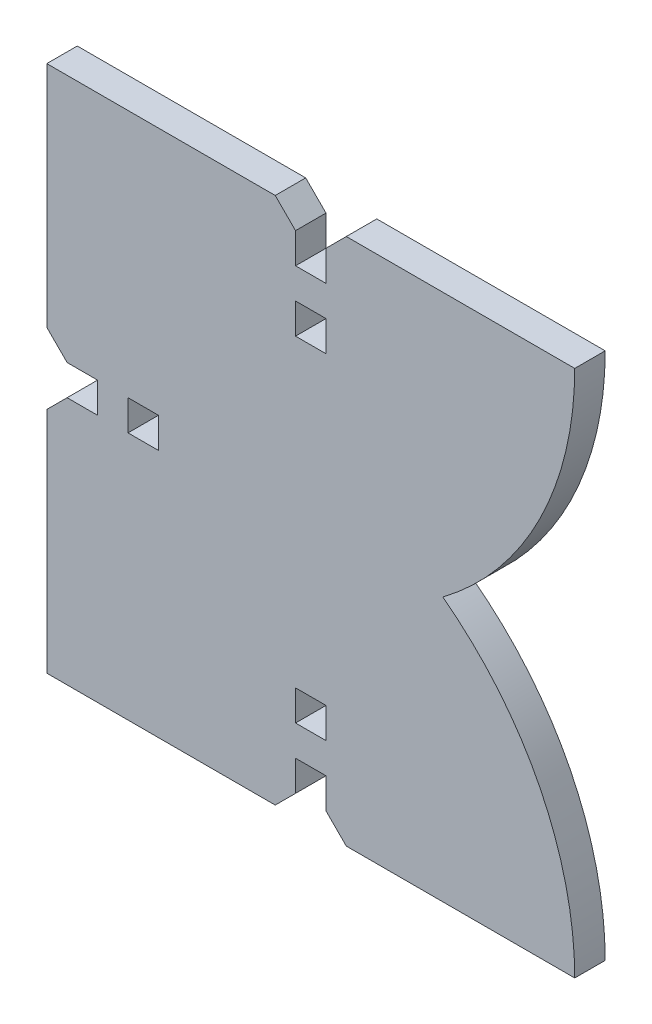
ISO-10303-21;
HEADER;
FILE_DESCRIPTION(('STEP AP214'),'2;1');
FILE_NAME('part.step','',(''),(''),'','','');
FILE_SCHEMA(('AUTOMOTIVE_DESIGN { 1 0 10303 214 1 1 1 1 }'));
ENDSEC;
DATA;
#1=APPLICATION_CONTEXT('core data for automotive mechanical design processes');
#2=APPLICATION_PROTOCOL_DEFINITION('international standard','automotive_design',2000,#1);
#3=PRODUCT_CONTEXT('',#1,'mechanical');
#4=PRODUCT('Part','Part','',(#3));
#5=PRODUCT_RELATED_PRODUCT_CATEGORY('part','',(#4));
#6=PRODUCT_DEFINITION_FORMATION('','',#4);
#7=PRODUCT_DEFINITION_CONTEXT('part definition',#1,'design');
#8=PRODUCT_DEFINITION('design','',#6,#7);
#9=PRODUCT_DEFINITION_SHAPE('','',#8);
#10=(LENGTH_UNIT() NAMED_UNIT(*) SI_UNIT(.MILLI.,.METRE.));
#11=(NAMED_UNIT(*) PLANE_ANGLE_UNIT() SI_UNIT($,.RADIAN.));
#12=(NAMED_UNIT(*) SI_UNIT($,.STERADIAN.) SOLID_ANGLE_UNIT());
#13=UNCERTAINTY_MEASURE_WITH_UNIT(LENGTH_MEASURE(1.E-05),#10,'distance_accuracy_value','');
#14=(GEOMETRIC_REPRESENTATION_CONTEXT(3) GLOBAL_UNCERTAINTY_ASSIGNED_CONTEXT((#13)) GLOBAL_UNIT_ASSIGNED_CONTEXT((#10,
#11,#12)) REPRESENTATION_CONTEXT('',''));
#15=CARTESIAN_POINT('',(0.,0.,0.));
#16=DIRECTION('',(0.,0.,1.));
#17=DIRECTION('',(1.,0.,0.));
#18=AXIS2_PLACEMENT_3D('',#15,#16,#17);
#19=CARTESIAN_POINT('',(0.,0.,3.));
#20=DIRECTION('',(0.,0.,1.));
#21=DIRECTION('',(1.,0.,0.));
#22=AXIS2_PLACEMENT_3D('',#19,#20,#21);
#23=PLANE('',#22);
#24=DIRECTION('',(0.,1.,0.));
#25=VECTOR('',#24,1.);
#26=CARTESIAN_POINT('',(-18.,-1.49999999999992,3.));
#27=LINE('',#26,#25);
#28=CARTESIAN_POINT('',(-18.,-1.49999999999992,3.));
#29=VERTEX_POINT('',#28);
#30=CARTESIAN_POINT('',(-18.,1.50000000000012,3.));
#31=VERTEX_POINT('',#30);
#32=EDGE_CURVE('E194',#29,#31,#27,.T.);
#33=ORIENTED_EDGE('',*,*,#32,.T.);
#34=DIRECTION('',(1.,0.,0.));
#35=VECTOR('',#34,1.);
#36=CARTESIAN_POINT('',(-18.,1.50000000000012,3.));
#37=LINE('',#36,#35);
#38=CARTESIAN_POINT('',(-15.,1.50000000000011,3.));
#39=VERTEX_POINT('',#38);
#40=EDGE_CURVE('E365',#31,#39,#37,.T.);
#41=ORIENTED_EDGE('',*,*,#40,.T.);
#42=DIRECTION('',(0.,-1.,0.));
#43=VECTOR('',#42,1.);
#44=CARTESIAN_POINT('',(-15.,0.,3.));
#45=LINE('',#44,#43);
#46=CARTESIAN_POINT('',(-15.,-1.49999999999993,3.));
#47=VERTEX_POINT('',#46);
#48=EDGE_CURVE('E188',#39,#47,#45,.T.);
#49=ORIENTED_EDGE('',*,*,#48,.T.);
#50=DIRECTION('',(-1.,0.,0.));
#51=VECTOR('',#50,1.);
#52=CARTESIAN_POINT('',(-15.,-1.49999999999993,3.));
#53=LINE('',#52,#51);
#54=EDGE_CURVE('E191',#47,#29,#53,.T.);
#55=ORIENTED_EDGE('',*,*,#54,.T.);
#56=EDGE_LOOP('',(#33,#41,#49,#55));
#57=FACE_BOUND('',#56,.T.);
#58=DIRECTION('',(-1.,0.,0.));
#59=VECTOR('',#58,1.);
#60=CARTESIAN_POINT('',(1.49999999999996,-18.,3.));
#61=LINE('',#60,#59);
#62=CARTESIAN_POINT('',(1.49999999999996,-18.,3.));
#63=VERTEX_POINT('',#62);
#64=CARTESIAN_POINT('',(-1.50000000000008,-18.,3.));
#65=VERTEX_POINT('',#64);
#66=EDGE_CURVE('E287',#63,#65,#61,.T.);
#67=ORIENTED_EDGE('',*,*,#66,.T.);
#68=DIRECTION('',(0.,1.,0.));
#69=VECTOR('',#68,1.);
#70=CARTESIAN_POINT('',(-1.50000000000008,-18.,3.));
#71=LINE('',#70,#69);
#72=CARTESIAN_POINT('',(-1.50000000000007,-15.,3.));
#73=VERTEX_POINT('',#72);
#74=EDGE_CURVE('E184',#65,#73,#71,.T.);
#75=ORIENTED_EDGE('',*,*,#74,.T.);
#76=DIRECTION('',(1.,0.,0.));
#77=VECTOR('',#76,1.);
#78=CARTESIAN_POINT('',(0.,-15.,3.));
#79=LINE('',#78,#77);
#80=CARTESIAN_POINT('',(1.49999999999996,-15.,3.));
#81=VERTEX_POINT('',#80);
#82=EDGE_CURVE('E280',#73,#81,#79,.T.);
#83=ORIENTED_EDGE('',*,*,#82,.T.);
#84=DIRECTION('',(0.,-1.,0.));
#85=VECTOR('',#84,1.);
#86=CARTESIAN_POINT('',(1.49999999999996,-15.,3.));
#87=LINE('',#86,#85);
#88=EDGE_CURVE('E283',#81,#63,#87,.T.);
#89=ORIENTED_EDGE('',*,*,#88,.T.);
#90=EDGE_LOOP('',(#67,#75,#83,#89));
#91=FACE_BOUND('',#90,.T.);
#92=DIRECTION('',(-1.,0.,0.));
#93=VECTOR('',#92,1.);
#94=CARTESIAN_POINT('',(1.5,15.,3.));
#95=LINE('',#94,#93);
#96=CARTESIAN_POINT('',(1.5,15.,3.));
#97=VERTEX_POINT('',#96);
#98=CARTESIAN_POINT('',(-1.4999999999999,15.,3.));
#99=VERTEX_POINT('',#98);
#100=EDGE_CURVE('E101',#97,#99,#95,.T.);
#101=ORIENTED_EDGE('',*,*,#100,.T.);
#102=DIRECTION('',(0.,1.,0.));
#103=VECTOR('',#102,1.);
#104=CARTESIAN_POINT('',(-1.4999999999999,15.,3.));
#105=LINE('',#104,#103);
#106=CARTESIAN_POINT('',(-1.49999999999988,18.,3.));
#107=VERTEX_POINT('',#106);
#108=EDGE_CURVE('E164',#99,#107,#105,.T.);
#109=ORIENTED_EDGE('',*,*,#108,.T.);
#110=DIRECTION('',(1.,0.,0.));
#111=VECTOR('',#110,1.);
#112=CARTESIAN_POINT('',(0.,18.,3.));
#113=LINE('',#112,#111);
#114=CARTESIAN_POINT('',(1.49999999999999,18.,3.));
#115=VERTEX_POINT('',#114);
#116=EDGE_CURVE('E104',#107,#115,#113,.T.);
#117=ORIENTED_EDGE('',*,*,#116,.T.);
#118=DIRECTION('',(0.,-1.,0.));
#119=VECTOR('',#118,1.);
#120=CARTESIAN_POINT('',(1.49999999999999,18.,3.));
#121=LINE('',#120,#119);
#122=EDGE_CURVE('E96',#115,#97,#121,.T.);
#123=ORIENTED_EDGE('',*,*,#122,.T.);
#124=EDGE_LOOP('',(#101,#109,#117,#123));
#125=FACE_BOUND('',#124,.T.);
#126=CARTESIAN_POINT('',(-6.50000000000052,-26.0000000000002,3.));
#127=DIRECTION('',(0.,0.,1.));
#128=DIRECTION('',(1.,0.,0.));
#129=AXIS2_PLACEMENT_3D('',#126,#127,#128);
#130=CIRCLE('',#129,32.5000000000005);
#131=CARTESIAN_POINT('',(13.,0.,3.));
#132=VERTEX_POINT('',#131);
#133=CARTESIAN_POINT('',(25.9999999999999,-26.0000000000001,3.));
#134=VERTEX_POINT('',#133);
#135=EDGE_CURVE('E382',#132,#134,#130,.F.);
#136=ORIENTED_EDGE('',*,*,#135,.F.);
#137=CARTESIAN_POINT('',(-6.50000000000001,26.,3.));
#138=DIRECTION('',(0.,0.,1.));
#139=DIRECTION('',(1.,0.,0.));
#140=AXIS2_PLACEMENT_3D('',#137,#138,#139);
#141=CIRCLE('',#140,32.5);
#142=CARTESIAN_POINT('',(26.,26.,3.));
#143=VERTEX_POINT('',#142);
#144=EDGE_CURVE('E555',#143,#132,#141,.F.);
#145=ORIENTED_EDGE('',*,*,#144,.F.);
#146=DIRECTION('',(-1.,0.,0.));
#147=VECTOR('',#146,1.);
#148=CARTESIAN_POINT('',(26.,26.,3.));
#149=LINE('',#148,#147);
#150=CARTESIAN_POINT('',(3.49999999999999,26.,3.));
#151=VERTEX_POINT('',#150);
#152=EDGE_CURVE('E123',#143,#151,#149,.T.);
#153=ORIENTED_EDGE('',*,*,#152,.T.);
#154=DIRECTION('',(-0.707106781186548,-0.707106781186547,0.));
#155=VECTOR('',#154,1.);
#156=CARTESIAN_POINT('',(3.49999999999999,26.,3.));
#157=LINE('',#156,#155);
#158=CARTESIAN_POINT('',(1.49999999999999,24.,3.));
#159=VERTEX_POINT('',#158);
#160=EDGE_CURVE('E51',#151,#159,#157,.T.);
#161=ORIENTED_EDGE('',*,*,#160,.T.);
#162=DIRECTION('',(0.,-1.,0.));
#163=VECTOR('',#162,1.);
#164=CARTESIAN_POINT('',(1.49999999999999,24.,3.));
#165=LINE('',#164,#163);
#166=CARTESIAN_POINT('',(1.49999999999999,21.,3.));
#167=VERTEX_POINT('',#166);
#168=EDGE_CURVE('E144',#159,#167,#165,.T.);
#169=ORIENTED_EDGE('',*,*,#168,.T.);
#170=DIRECTION('',(-1.,0.,0.));
#171=VECTOR('',#170,1.);
#172=CARTESIAN_POINT('',(0.,21.,3.));
#173=LINE('',#172,#171);
#174=CARTESIAN_POINT('',(-1.49999999999986,21.,3.));
#175=VERTEX_POINT('',#174);
#176=EDGE_CURVE('E86',#167,#175,#173,.T.);
#177=ORIENTED_EDGE('',*,*,#176,.T.);
#178=DIRECTION('',(0.,1.,0.));
#179=VECTOR('',#178,1.);
#180=CARTESIAN_POINT('',(-1.49999999999986,21.,3.));
#181=LINE('',#180,#179);
#182=CARTESIAN_POINT('',(-1.49999999999983,24.,3.));
#183=VERTEX_POINT('',#182);
#184=EDGE_CURVE('E345',#175,#183,#181,.T.);
#185=ORIENTED_EDGE('',*,*,#184,.T.);
#186=DIRECTION('',(-0.707106781186542,0.707106781186553,0.));
#187=VECTOR('',#186,1.);
#188=CARTESIAN_POINT('',(-1.49999999999983,24.,3.));
#189=LINE('',#188,#187);
#190=CARTESIAN_POINT('',(-3.49999999999982,26.,3.));
#191=VERTEX_POINT('',#190);
#192=EDGE_CURVE('E361',#183,#191,#189,.T.);
#193=ORIENTED_EDGE('',*,*,#192,.T.);
#194=DIRECTION('',(-1.,0.,0.));
#195=VECTOR('',#194,1.);
#196=CARTESIAN_POINT('',(-3.49999999999982,26.,3.));
#197=LINE('',#196,#195);
#198=CARTESIAN_POINT('',(-25.9999999999998,26.0000000000002,3.));
#199=VERTEX_POINT('',#198);
#200=EDGE_CURVE('E363',#191,#199,#197,.T.);
#201=ORIENTED_EDGE('',*,*,#200,.T.);
#202=DIRECTION('',(0.,-1.,0.));
#203=VECTOR('',#202,1.);
#204=CARTESIAN_POINT('',(-25.9999999999998,26.0000000000002,3.));
#205=LINE('',#204,#203);
#206=CARTESIAN_POINT('',(-26.,3.50000000000017,3.));
#207=VERTEX_POINT('',#206);
#208=EDGE_CURVE('E371',#199,#207,#205,.T.);
#209=ORIENTED_EDGE('',*,*,#208,.T.);
#210=DIRECTION('',(0.707106781186542,-0.707106781186553,0.));
#211=VECTOR('',#210,1.);
#212=CARTESIAN_POINT('',(-26.,3.50000000000017,3.));
#213=LINE('',#212,#211);
#214=CARTESIAN_POINT('',(-24.,1.50000000000016,3.));
#215=VERTEX_POINT('',#214);
#216=EDGE_CURVE('E374',#207,#215,#213,.T.);
#217=ORIENTED_EDGE('',*,*,#216,.T.);
#218=DIRECTION('',(1.,0.,0.));
#219=VECTOR('',#218,1.);
#220=CARTESIAN_POINT('',(-24.,1.50000000000016,3.));
#221=LINE('',#220,#219);
#222=CARTESIAN_POINT('',(-21.,1.50000000000014,3.));
#223=VERTEX_POINT('',#222);
#224=EDGE_CURVE('E400',#215,#223,#221,.T.);
#225=ORIENTED_EDGE('',*,*,#224,.T.);
#226=DIRECTION('',(0.,-1.,0.));
#227=VECTOR('',#226,1.);
#228=CARTESIAN_POINT('',(-21.,1.00012849197155E-13,3.));
#229=LINE('',#228,#227);
#230=CARTESIAN_POINT('',(-21.,-1.4999999999999,3.));
#231=VERTEX_POINT('',#230);
#232=EDGE_CURVE('E197',#223,#231,#229,.T.);
#233=ORIENTED_EDGE('',*,*,#232,.T.);
#234=DIRECTION('',(-1.,0.,0.));
#235=VECTOR('',#234,1.);
#236=CARTESIAN_POINT('',(-21.,-1.4999999999999,3.));
#237=LINE('',#236,#235);
#238=CARTESIAN_POINT('',(-24.,-1.49999999999989,3.));
#239=VERTEX_POINT('',#238);
#240=EDGE_CURVE('E200',#231,#239,#237,.T.);
#241=ORIENTED_EDGE('',*,*,#240,.T.);
#242=DIRECTION('',(-0.707106781186552,-0.707106781186543,0.));
#243=VECTOR('',#242,1.);
#244=CARTESIAN_POINT('',(-24.,-1.49999999999989,3.));
#245=LINE('',#244,#243);
#246=CARTESIAN_POINT('',(-26.,-3.49999999999987,3.));
#247=VERTEX_POINT('',#246);
#248=EDGE_CURVE('E203',#239,#247,#245,.T.);
#249=ORIENTED_EDGE('',*,*,#248,.T.);
#250=DIRECTION('',(0.,-1.,0.));
#251=VECTOR('',#250,1.);
#252=CARTESIAN_POINT('',(-26.,-3.49999999999987,3.));
#253=LINE('',#252,#251);
#254=CARTESIAN_POINT('',(-26.0000000000001,-25.9999999999999,3.));
#255=VERTEX_POINT('',#254);
#256=EDGE_CURVE('E206',#247,#255,#253,.T.);
#257=ORIENTED_EDGE('',*,*,#256,.T.);
#258=DIRECTION('',(1.,0.,0.));
#259=VECTOR('',#258,1.);
#260=CARTESIAN_POINT('',(-26.0000000000001,-25.9999999999999,3.));
#261=LINE('',#260,#259);
#262=CARTESIAN_POINT('',(-3.50000000000012,-26.,3.));
#263=VERTEX_POINT('',#262);
#264=EDGE_CURVE('E209',#255,#263,#261,.T.);
#265=ORIENTED_EDGE('',*,*,#264,.T.);
#266=DIRECTION('',(0.707106781186551,0.707106781186544,0.));
#267=VECTOR('',#266,1.);
#268=CARTESIAN_POINT('',(-3.50000000000012,-26.,3.));
#269=LINE('',#268,#267);
#270=CARTESIAN_POINT('',(-1.50000000000011,-24.,3.));
#271=VERTEX_POINT('',#270);
#272=EDGE_CURVE('E212',#263,#271,#269,.T.);
#273=ORIENTED_EDGE('',*,*,#272,.T.);
#274=DIRECTION('',(0.,1.,0.));
#275=VECTOR('',#274,1.);
#276=CARTESIAN_POINT('',(-1.50000000000011,-24.,3.));
#277=LINE('',#276,#275);
#278=CARTESIAN_POINT('',(-1.50000000000009,-21.,3.));
#279=VERTEX_POINT('',#278);
#280=EDGE_CURVE('E181',#271,#279,#277,.T.);
#281=ORIENTED_EDGE('',*,*,#280,.T.);
#282=DIRECTION('',(1.,0.,0.));
#283=VECTOR('',#282,1.);
#284=CARTESIAN_POINT('',(0.,-21.,3.));
#285=LINE('',#284,#283);
#286=CARTESIAN_POINT('',(1.49999999999995,-21.,3.));
#287=VERTEX_POINT('',#286);
#288=EDGE_CURVE('E290',#279,#287,#285,.T.);
#289=ORIENTED_EDGE('',*,*,#288,.T.);
#290=DIRECTION('',(0.,-1.,0.));
#291=VECTOR('',#290,1.);
#292=CARTESIAN_POINT('',(1.49999999999995,-21.,3.));
#293=LINE('',#292,#291);
#294=CARTESIAN_POINT('',(1.49999999999994,-24.,3.));
#295=VERTEX_POINT('',#294);
#296=EDGE_CURVE('E293',#287,#295,#293,.T.);
#297=ORIENTED_EDGE('',*,*,#296,.T.);
#298=DIRECTION('',(0.707106781186545,-0.70710678118655,0.));
#299=VECTOR('',#298,1.);
#300=CARTESIAN_POINT('',(1.49999999999994,-24.,3.));
#301=LINE('',#300,#299);
#302=CARTESIAN_POINT('',(3.49999999999994,-26.,3.));
#303=VERTEX_POINT('',#302);
#304=EDGE_CURVE('E296',#295,#303,#301,.T.);
#305=ORIENTED_EDGE('',*,*,#304,.T.);
#306=DIRECTION('',(1.,0.,0.));
#307=VECTOR('',#306,1.);
#308=CARTESIAN_POINT('',(3.49999999999994,-26.,3.));
#309=LINE('',#308,#307);
#310=EDGE_CURVE('E299',#303,#134,#309,.T.);
#311=ORIENTED_EDGE('',*,*,#310,.T.);
#312=EDGE_LOOP('',(#136,#145,#153,#161,#169,#177,#185,#193,#201,#209,#217,#225,#233,#241,#249,
#257,#265,#273,#281,#289,#297,#305,#311));
#313=FACE_BOUND('',#312,.T.);
#314=ADVANCED_FACE('F34',(#57,#91,#125,#313),#23,.T.);
#315=CARTESIAN_POINT('',(0.,0.,0.));
#316=DIRECTION('',(0.,0.,1.));
#317=DIRECTION('',(1.,0.,0.));
#318=AXIS2_PLACEMENT_3D('',#315,#316,#317);
#319=PLANE('',#318);
#320=DIRECTION('',(1.,0.,0.));
#321=VECTOR('',#320,1.);
#322=CARTESIAN_POINT('',(-18.,1.50000000000012,0.));
#323=LINE('',#322,#321);
#324=CARTESIAN_POINT('',(-18.,1.50000000000012,0.));
#325=VERTEX_POINT('',#324);
#326=CARTESIAN_POINT('',(-15.,1.50000000000011,0.));
#327=VERTEX_POINT('',#326);
#328=EDGE_CURVE('E381',#325,#327,#323,.T.);
#329=ORIENTED_EDGE('',*,*,#328,.F.);
#330=DIRECTION('',(0.,1.,0.));
#331=VECTOR('',#330,1.);
#332=CARTESIAN_POINT('',(-18.,-1.49999999999992,0.));
#333=LINE('',#332,#331);
#334=CARTESIAN_POINT('',(-18.,-1.49999999999992,0.));
#335=VERTEX_POINT('',#334);
#336=EDGE_CURVE('E227',#335,#325,#333,.T.);
#337=ORIENTED_EDGE('',*,*,#336,.F.);
#338=DIRECTION('',(-1.,0.,0.));
#339=VECTOR('',#338,1.);
#340=CARTESIAN_POINT('',(-15.,-1.49999999999993,0.));
#341=LINE('',#340,#339);
#342=CARTESIAN_POINT('',(-15.,-1.49999999999993,0.));
#343=VERTEX_POINT('',#342);
#344=EDGE_CURVE('E224',#343,#335,#341,.T.);
#345=ORIENTED_EDGE('',*,*,#344,.F.);
#346=DIRECTION('',(0.,-1.,0.));
#347=VECTOR('',#346,1.);
#348=CARTESIAN_POINT('',(-15.,0.,0.));
#349=LINE('',#348,#347);
#350=EDGE_CURVE('E221',#327,#343,#349,.T.);
#351=ORIENTED_EDGE('',*,*,#350,.F.);
#352=EDGE_LOOP('',(#329,#337,#345,#351));
#353=FACE_BOUND('',#352,.T.);
#354=DIRECTION('',(0.,1.,0.));
#355=VECTOR('',#354,1.);
#356=CARTESIAN_POINT('',(-1.50000000000008,-18.,0.));
#357=LINE('',#356,#355);
#358=CARTESIAN_POINT('',(-1.50000000000008,-18.,0.));
#359=VERTEX_POINT('',#358);
#360=CARTESIAN_POINT('',(-1.50000000000007,-15.,0.));
#361=VERTEX_POINT('',#360);
#362=EDGE_CURVE('E218',#359,#361,#357,.T.);
#363=ORIENTED_EDGE('',*,*,#362,.F.);
#364=DIRECTION('',(-1.,0.,0.));
#365=VECTOR('',#364,1.);
#366=CARTESIAN_POINT('',(1.49999999999996,-18.,0.));
#367=LINE('',#366,#365);
#368=CARTESIAN_POINT('',(1.49999999999996,-18.,0.));
#369=VERTEX_POINT('',#368);
#370=EDGE_CURVE('E308',#369,#359,#367,.T.);
#371=ORIENTED_EDGE('',*,*,#370,.F.);
#372=DIRECTION('',(0.,-1.,0.));
#373=VECTOR('',#372,1.);
#374=CARTESIAN_POINT('',(1.49999999999996,-15.,0.));
#375=LINE('',#374,#373);
#376=CARTESIAN_POINT('',(1.49999999999996,-15.,0.));
#377=VERTEX_POINT('',#376);
#378=EDGE_CURVE('E305',#377,#369,#375,.T.);
#379=ORIENTED_EDGE('',*,*,#378,.F.);
#380=DIRECTION('',(1.,0.,0.));
#381=VECTOR('',#380,1.);
#382=CARTESIAN_POINT('',(0.,-15.,0.));
#383=LINE('',#382,#381);
#384=EDGE_CURVE('E279',#361,#377,#383,.T.);
#385=ORIENTED_EDGE('',*,*,#384,.F.);
#386=EDGE_LOOP('',(#363,#371,#379,#385));
#387=FACE_BOUND('',#386,.T.);
#388=DIRECTION('',(0.,1.,0.));
#389=VECTOR('',#388,1.);
#390=CARTESIAN_POINT('',(-1.4999999999999,15.,0.));
#391=LINE('',#390,#389);
#392=CARTESIAN_POINT('',(-1.4999999999999,15.,0.));
#393=VERTEX_POINT('',#392);
#394=CARTESIAN_POINT('',(-1.49999999999988,18.,0.));
#395=VERTEX_POINT('',#394);
#396=EDGE_CURVE('E157',#393,#395,#391,.T.);
#397=ORIENTED_EDGE('',*,*,#396,.F.);
#398=DIRECTION('',(-1.,0.,0.));
#399=VECTOR('',#398,1.);
#400=CARTESIAN_POINT('',(1.5,15.,0.));
#401=LINE('',#400,#399);
#402=CARTESIAN_POINT('',(1.5,15.,0.));
#403=VERTEX_POINT('',#402);
#404=EDGE_CURVE('E140',#403,#393,#401,.T.);
#405=ORIENTED_EDGE('',*,*,#404,.F.);
#406=DIRECTION('',(0.,-1.,0.));
#407=VECTOR('',#406,1.);
#408=CARTESIAN_POINT('',(1.49999999999999,18.,0.));
#409=LINE('',#408,#407);
#410=CARTESIAN_POINT('',(1.49999999999999,18.,0.));
#411=VERTEX_POINT('',#410);
#412=EDGE_CURVE('E113',#411,#403,#409,.T.);
#413=ORIENTED_EDGE('',*,*,#412,.F.);
#414=DIRECTION('',(1.,0.,0.));
#415=VECTOR('',#414,1.);
#416=CARTESIAN_POINT('',(0.,18.,0.));
#417=LINE('',#416,#415);
#418=EDGE_CURVE('E137',#395,#411,#417,.T.);
#419=ORIENTED_EDGE('',*,*,#418,.F.);
#420=EDGE_LOOP('',(#397,#405,#413,#419));
#421=FACE_BOUND('',#420,.T.);
#422=CARTESIAN_POINT('',(-6.50000000000001,26.,0.));
#423=DIRECTION('',(0.,0.,-1.));
#424=DIRECTION('',(-1.,0.,0.));
#425=AXIS2_PLACEMENT_3D('',#422,#423,#424);
#426=CIRCLE('',#425,32.5);
#427=CARTESIAN_POINT('',(26.,26.,0.));
#428=VERTEX_POINT('',#427);
#429=CARTESIAN_POINT('',(13.,0.,0.));
#430=VERTEX_POINT('',#429);
#431=EDGE_CURVE('E546',#428,#430,#426,.T.);
#432=ORIENTED_EDGE('',*,*,#431,.T.);
#433=CARTESIAN_POINT('',(-6.50000000000052,-26.0000000000002,0.));
#434=DIRECTION('',(0.,0.,-1.));
#435=DIRECTION('',(1.,0.,0.));
#436=AXIS2_PLACEMENT_3D('',#433,#434,#435);
#437=CIRCLE('',#436,32.5000000000005);
#438=CARTESIAN_POINT('',(25.9999999999999,-26.0000000000001,0.));
#439=VERTEX_POINT('',#438);
#440=EDGE_CURVE('E543',#430,#439,#437,.T.);
#441=ORIENTED_EDGE('',*,*,#440,.T.);
#442=DIRECTION('',(1.,0.,0.));
#443=VECTOR('',#442,1.);
#444=CARTESIAN_POINT('',(3.49999999999994,-26.,0.));
#445=LINE('',#444,#443);
#446=CARTESIAN_POINT('',(3.49999999999994,-26.,0.));
#447=VERTEX_POINT('',#446);
#448=EDGE_CURVE('E284',#447,#439,#445,.T.);
#449=ORIENTED_EDGE('',*,*,#448,.F.);
#450=DIRECTION('',(0.707106781186545,-0.70710678118655,0.));
#451=VECTOR('',#450,1.);
#452=CARTESIAN_POINT('',(1.49999999999994,-24.,0.));
#453=LINE('',#452,#451);
#454=CARTESIAN_POINT('',(1.49999999999994,-24.,0.));
#455=VERTEX_POINT('',#454);
#456=EDGE_CURVE('E317',#455,#447,#453,.T.);
#457=ORIENTED_EDGE('',*,*,#456,.F.);
#458=DIRECTION('',(0.,-1.,0.));
#459=VECTOR('',#458,1.);
#460=CARTESIAN_POINT('',(1.49999999999995,-21.,0.));
#461=LINE('',#460,#459);
#462=CARTESIAN_POINT('',(1.49999999999995,-21.,0.));
#463=VERTEX_POINT('',#462);
#464=EDGE_CURVE('E314',#463,#455,#461,.T.);
#465=ORIENTED_EDGE('',*,*,#464,.F.);
#466=DIRECTION('',(1.,0.,0.));
#467=VECTOR('',#466,1.);
#468=CARTESIAN_POINT('',(0.,-21.,0.));
#469=LINE('',#468,#467);
#470=CARTESIAN_POINT('',(-1.50000000000009,-21.,0.));
#471=VERTEX_POINT('',#470);
#472=EDGE_CURVE('E311',#471,#463,#469,.T.);
#473=ORIENTED_EDGE('',*,*,#472,.F.);
#474=DIRECTION('',(0.,1.,0.));
#475=VECTOR('',#474,1.);
#476=CARTESIAN_POINT('',(-1.50000000000011,-24.,0.));
#477=LINE('',#476,#475);
#478=CARTESIAN_POINT('',(-1.50000000000011,-24.,0.));
#479=VERTEX_POINT('',#478);
#480=EDGE_CURVE('E180',#479,#471,#477,.T.);
#481=ORIENTED_EDGE('',*,*,#480,.F.);
#482=DIRECTION('',(0.707106781186551,0.707106781186544,0.));
#483=VECTOR('',#482,1.);
#484=CARTESIAN_POINT('',(-3.50000000000012,-26.,0.));
#485=LINE('',#484,#483);
#486=CARTESIAN_POINT('',(-3.50000000000012,-26.,0.));
#487=VERTEX_POINT('',#486);
#488=EDGE_CURVE('E185',#487,#479,#485,.T.);
#489=ORIENTED_EDGE('',*,*,#488,.F.);
#490=DIRECTION('',(1.,0.,0.));
#491=VECTOR('',#490,1.);
#492=CARTESIAN_POINT('',(-26.0000000000001,-25.9999999999999,0.));
#493=LINE('',#492,#491);
#494=CARTESIAN_POINT('',(-26.0000000000001,-25.9999999999999,0.));
#495=VERTEX_POINT('',#494);
#496=EDGE_CURVE('E242',#495,#487,#493,.T.);
#497=ORIENTED_EDGE('',*,*,#496,.F.);
#498=DIRECTION('',(0.,-1.,0.));
#499=VECTOR('',#498,1.);
#500=CARTESIAN_POINT('',(-26.,-3.49999999999987,0.));
#501=LINE('',#500,#499);
#502=CARTESIAN_POINT('',(-26.,-3.49999999999987,0.));
#503=VERTEX_POINT('',#502);
#504=EDGE_CURVE('E239',#503,#495,#501,.T.);
#505=ORIENTED_EDGE('',*,*,#504,.F.);
#506=DIRECTION('',(-0.707106781186552,-0.707106781186543,0.));
#507=VECTOR('',#506,1.);
#508=CARTESIAN_POINT('',(-24.,-1.49999999999989,0.));
#509=LINE('',#508,#507);
#510=CARTESIAN_POINT('',(-24.,-1.49999999999989,0.));
#511=VERTEX_POINT('',#510);
#512=EDGE_CURVE('E236',#511,#503,#509,.T.);
#513=ORIENTED_EDGE('',*,*,#512,.F.);
#514=DIRECTION('',(-1.,0.,0.));
#515=VECTOR('',#514,1.);
#516=CARTESIAN_POINT('',(-21.,-1.4999999999999,0.));
#517=LINE('',#516,#515);
#518=CARTESIAN_POINT('',(-21.,-1.4999999999999,0.));
#519=VERTEX_POINT('',#518);
#520=EDGE_CURVE('E233',#519,#511,#517,.T.);
#521=ORIENTED_EDGE('',*,*,#520,.F.);
#522=DIRECTION('',(0.,-1.,0.));
#523=VECTOR('',#522,1.);
#524=CARTESIAN_POINT('',(-21.,1.00012849197155E-13,0.));
#525=LINE('',#524,#523);
#526=CARTESIAN_POINT('',(-21.,1.50000000000014,0.));
#527=VERTEX_POINT('',#526);
#528=EDGE_CURVE('E230',#527,#519,#525,.T.);
#529=ORIENTED_EDGE('',*,*,#528,.F.);
#530=DIRECTION('',(1.,0.,0.));
#531=VECTOR('',#530,1.);
#532=CARTESIAN_POINT('',(-24.,1.50000000000016,0.));
#533=LINE('',#532,#531);
#534=CARTESIAN_POINT('',(-24.,1.50000000000016,0.));
#535=VERTEX_POINT('',#534);
#536=EDGE_CURVE('E378',#535,#527,#533,.T.);
#537=ORIENTED_EDGE('',*,*,#536,.F.);
#538=DIRECTION('',(0.707106781186542,-0.707106781186553,0.));
#539=VECTOR('',#538,1.);
#540=CARTESIAN_POINT('',(-26.,3.50000000000017,0.));
#541=LINE('',#540,#539);
#542=CARTESIAN_POINT('',(-26.,3.50000000000017,0.));
#543=VERTEX_POINT('',#542);
#544=EDGE_CURVE('E397',#543,#535,#541,.T.);
#545=ORIENTED_EDGE('',*,*,#544,.F.);
#546=DIRECTION('',(0.,-1.,0.));
#547=VECTOR('',#546,1.);
#548=CARTESIAN_POINT('',(-25.9999999999998,26.0000000000002,0.));
#549=LINE('',#548,#547);
#550=CARTESIAN_POINT('',(-25.9999999999998,26.0000000000002,0.));
#551=VERTEX_POINT('',#550);
#552=EDGE_CURVE('E394',#551,#543,#549,.T.);
#553=ORIENTED_EDGE('',*,*,#552,.F.);
#554=DIRECTION('',(-1.,0.,0.));
#555=VECTOR('',#554,1.);
#556=CARTESIAN_POINT('',(-3.49999999999982,26.,0.));
#557=LINE('',#556,#555);
#558=CARTESIAN_POINT('',(-3.49999999999982,26.,0.));
#559=VERTEX_POINT('',#558);
#560=EDGE_CURVE('E391',#559,#551,#557,.T.);
#561=ORIENTED_EDGE('',*,*,#560,.F.);
#562=DIRECTION('',(-0.707106781186542,0.707106781186553,0.));
#563=VECTOR('',#562,1.);
#564=CARTESIAN_POINT('',(-1.49999999999983,24.,0.));
#565=LINE('',#564,#563);
#566=CARTESIAN_POINT('',(-1.49999999999983,24.,0.));
#567=VERTEX_POINT('',#566);
#568=EDGE_CURVE('E388',#567,#559,#565,.T.);
#569=ORIENTED_EDGE('',*,*,#568,.F.);
#570=DIRECTION('',(0.,1.,0.));
#571=VECTOR('',#570,1.);
#572=CARTESIAN_POINT('',(-1.49999999999986,21.,0.));
#573=LINE('',#572,#571);
#574=CARTESIAN_POINT('',(-1.49999999999986,21.,0.));
#575=VERTEX_POINT('',#574);
#576=EDGE_CURVE('E386',#575,#567,#573,.T.);
#577=ORIENTED_EDGE('',*,*,#576,.F.);
#578=DIRECTION('',(-1.,0.,0.));
#579=VECTOR('',#578,1.);
#580=CARTESIAN_POINT('',(0.,21.,0.));
#581=LINE('',#580,#579);
#582=CARTESIAN_POINT('',(1.49999999999999,21.,0.));
#583=VERTEX_POINT('',#582);
#584=EDGE_CURVE('E133',#583,#575,#581,.T.);
#585=ORIENTED_EDGE('',*,*,#584,.F.);
#586=DIRECTION('',(0.,-1.,0.));
#587=VECTOR('',#586,1.);
#588=CARTESIAN_POINT('',(1.49999999999999,24.,0.));
#589=LINE('',#588,#587);
#590=CARTESIAN_POINT('',(1.49999999999999,24.,0.));
#591=VERTEX_POINT('',#590);
#592=EDGE_CURVE('E130',#591,#583,#589,.T.);
#593=ORIENTED_EDGE('',*,*,#592,.F.);
#594=DIRECTION('',(-0.707106781186548,-0.707106781186547,0.));
#595=VECTOR('',#594,1.);
#596=CARTESIAN_POINT('',(3.49999999999999,26.,0.));
#597=LINE('',#596,#595);
#598=CARTESIAN_POINT('',(3.49999999999999,26.,0.));
#599=VERTEX_POINT('',#598);
#600=EDGE_CURVE('E78',#599,#591,#597,.T.);
#601=ORIENTED_EDGE('',*,*,#600,.F.);
#602=DIRECTION('',(-1.,0.,0.));
#603=VECTOR('',#602,1.);
#604=CARTESIAN_POINT('',(26.,26.,0.));
#605=LINE('',#604,#603);
#606=EDGE_CURVE('E72',#428,#599,#605,.T.);
#607=ORIENTED_EDGE('',*,*,#606,.F.);
#608=EDGE_LOOP('',(#432,#441,#449,#457,#465,#473,#481,#489,#497,#505,#513,#521,#529,#537,#545,
#553,#561,#569,#577,#585,#593,#601,#607));
#609=FACE_BOUND('',#608,.T.);
#610=ADVANCED_FACE('F152',(#353,#387,#421,#609),#319,.F.);
#611=CARTESIAN_POINT('',(1.49999999999999,24.,3.));
#612=DIRECTION('',(1.,0.,0.));
#613=DIRECTION('',(0.,1.,0.));
#614=AXIS2_PLACEMENT_3D('',#611,#612,#613);
#615=PLANE('',#614);
#616=ORIENTED_EDGE('',*,*,#592,.T.);
#617=DIRECTION('',(0.,0.,-1.));
#618=VECTOR('',#617,1.);
#619=CARTESIAN_POINT('',(1.49999999999999,21.,3.));
#620=LINE('',#619,#618);
#621=EDGE_CURVE('E11',#167,#583,#620,.T.);
#622=ORIENTED_EDGE('',*,*,#621,.F.);
#623=ORIENTED_EDGE('',*,*,#168,.F.);
#624=DIRECTION('',(0.,0.,-1.));
#625=VECTOR('',#624,1.);
#626=CARTESIAN_POINT('',(1.49999999999999,24.,3.));
#627=LINE('',#626,#625);
#628=EDGE_CURVE('E129',#159,#591,#627,.T.);
#629=ORIENTED_EDGE('',*,*,#628,.T.);
#630=EDGE_LOOP('',(#616,#622,#623,#629));
#631=FACE_BOUND('',#630,.T.);
#632=ADVANCED_FACE('F36',(#631),#615,.F.);
#633=CARTESIAN_POINT('',(0.,21.,3.));
#634=DIRECTION('',(0.,-1.,0.));
#635=DIRECTION('',(0.,0.,-1.));
#636=AXIS2_PLACEMENT_3D('',#633,#634,#635);
#637=PLANE('',#636);
#638=ORIENTED_EDGE('',*,*,#584,.T.);
#639=DIRECTION('',(0.,0.,-1.));
#640=VECTOR('',#639,1.);
#641=CARTESIAN_POINT('',(-1.49999999999986,21.,3.));
#642=LINE('',#641,#640);
#643=EDGE_CURVE('E171',#175,#575,#642,.T.);
#644=ORIENTED_EDGE('',*,*,#643,.F.);
#645=ORIENTED_EDGE('',*,*,#176,.F.);
#646=ORIENTED_EDGE('',*,*,#621,.T.);
#647=EDGE_LOOP('',(#638,#644,#645,#646));
#648=FACE_BOUND('',#647,.T.);
#649=ADVANCED_FACE('F352',(#648),#637,.F.);
#650=CARTESIAN_POINT('',(0.,18.,3.));
#651=DIRECTION('',(0.,1.,0.));
#652=DIRECTION('',(0.,0.,1.));
#653=AXIS2_PLACEMENT_3D('',#650,#651,#652);
#654=PLANE('',#653);
#655=ORIENTED_EDGE('',*,*,#418,.T.);
#656=DIRECTION('',(0.,0.,-1.));
#657=VECTOR('',#656,1.);
#658=CARTESIAN_POINT('',(1.49999999999999,18.,3.));
#659=LINE('',#658,#657);
#660=EDGE_CURVE('E43',#115,#411,#659,.T.);
#661=ORIENTED_EDGE('',*,*,#660,.F.);
#662=ORIENTED_EDGE('',*,*,#116,.F.);
#663=DIRECTION('',(0.,0.,-1.));
#664=VECTOR('',#663,1.);
#665=CARTESIAN_POINT('',(-1.49999999999988,18.,3.));
#666=LINE('',#665,#664);
#667=EDGE_CURVE('E166',#107,#395,#666,.T.);
#668=ORIENTED_EDGE('',*,*,#667,.T.);
#669=EDGE_LOOP('',(#655,#661,#662,#668));
#670=FACE_BOUND('',#669,.T.);
#671=ADVANCED_FACE('F632',(#670),#654,.F.);
#672=CARTESIAN_POINT('',(1.49999999999999,18.,3.));
#673=DIRECTION('',(1.,0.,0.));
#674=DIRECTION('',(0.,1.,0.));
#675=AXIS2_PLACEMENT_3D('',#672,#673,#674);
#676=PLANE('',#675);
#677=ORIENTED_EDGE('',*,*,#412,.T.);
#678=DIRECTION('',(0.,0.,-1.));
#679=VECTOR('',#678,1.);
#680=CARTESIAN_POINT('',(1.5,15.,3.));
#681=LINE('',#680,#679);
#682=EDGE_CURVE('E110',#97,#403,#681,.T.);
#683=ORIENTED_EDGE('',*,*,#682,.F.);
#684=ORIENTED_EDGE('',*,*,#122,.F.);
#685=ORIENTED_EDGE('',*,*,#660,.T.);
#686=EDGE_LOOP('',(#677,#683,#684,#685));
#687=FACE_BOUND('',#686,.T.);
#688=ADVANCED_FACE('F111',(#687),#676,.F.);
#689=CARTESIAN_POINT('',(1.5,15.,3.));
#690=DIRECTION('',(0.,-1.,0.));
#691=DIRECTION('',(0.,0.,-1.));
#692=AXIS2_PLACEMENT_3D('',#689,#690,#691);
#693=PLANE('',#692);
#694=ORIENTED_EDGE('',*,*,#404,.T.);
#695=DIRECTION('',(0.,0.,-1.));
#696=VECTOR('',#695,1.);
#697=CARTESIAN_POINT('',(-1.4999999999999,15.,3.));
#698=LINE('',#697,#696);
#699=EDGE_CURVE('E121',#99,#393,#698,.T.);
#700=ORIENTED_EDGE('',*,*,#699,.F.);
#701=ORIENTED_EDGE('',*,*,#100,.F.);
#702=ORIENTED_EDGE('',*,*,#682,.T.);
#703=EDGE_LOOP('',(#694,#700,#701,#702));
#704=FACE_BOUND('',#703,.T.);
#705=ADVANCED_FACE('F119',(#704),#693,.F.);
#706=CARTESIAN_POINT('',(26.,26.,3.));
#707=DIRECTION('',(0.,-1.,0.));
#708=DIRECTION('',(1.,0.,0.));
#709=AXIS2_PLACEMENT_3D('',#706,#707,#708);
#710=PLANE('',#709);
#711=ORIENTED_EDGE('',*,*,#606,.T.);
#712=DIRECTION('',(0.,0.,-1.));
#713=VECTOR('',#712,1.);
#714=CARTESIAN_POINT('',(3.49999999999999,26.,3.));
#715=LINE('',#714,#713);
#716=EDGE_CURVE('E146',#151,#599,#715,.T.);
#717=ORIENTED_EDGE('',*,*,#716,.F.);
#718=ORIENTED_EDGE('',*,*,#152,.F.);
#719=DIRECTION('',(0.,0.,-1.));
#720=VECTOR('',#719,1.);
#721=CARTESIAN_POINT('',(26.,26.,3.));
#722=LINE('',#721,#720);
#723=EDGE_CURVE('E117',#143,#428,#722,.T.);
#724=ORIENTED_EDGE('',*,*,#723,.T.);
#725=EDGE_LOOP('',(#711,#717,#718,#724));
#726=FACE_BOUND('',#725,.T.);
#727=ADVANCED_FACE('F625',(#726),#710,.F.);
#728=CARTESIAN_POINT('',(3.49999999999999,26.,3.));
#729=DIRECTION('',(0.707106781186547,-0.707106781186548,0.));
#730=DIRECTION('',(0.707106781186548,0.707106781186547,0.));
#731=AXIS2_PLACEMENT_3D('',#728,#729,#730);
#732=PLANE('',#731);
#733=ORIENTED_EDGE('',*,*,#600,.T.);
#734=ORIENTED_EDGE('',*,*,#628,.F.);
#735=ORIENTED_EDGE('',*,*,#160,.F.);
#736=ORIENTED_EDGE('',*,*,#716,.T.);
#737=EDGE_LOOP('',(#733,#734,#735,#736));
#738=FACE_BOUND('',#737,.T.);
#739=ADVANCED_FACE('F616',(#738),#732,.F.);
#740=CARTESIAN_POINT('',(0.,-15.,3.));
#741=DIRECTION('',(0.,1.,0.));
#742=DIRECTION('',(-1.,0.,0.));
#743=AXIS2_PLACEMENT_3D('',#740,#741,#742);
#744=PLANE('',#743);
#745=ORIENTED_EDGE('',*,*,#384,.T.);
#746=DIRECTION('',(0.,0.,-1.));
#747=VECTOR('',#746,1.);
#748=CARTESIAN_POINT('',(1.49999999999996,-15.,3.));
#749=LINE('',#748,#747);
#750=EDGE_CURVE('E134',#81,#377,#749,.T.);
#751=ORIENTED_EDGE('',*,*,#750,.F.);
#752=ORIENTED_EDGE('',*,*,#82,.F.);
#753=DIRECTION('',(0.,0.,-1.));
#754=VECTOR('',#753,1.);
#755=CARTESIAN_POINT('',(-1.50000000000007,-15.,3.));
#756=LINE('',#755,#754);
#757=EDGE_CURVE('E270',#73,#361,#756,.T.);
#758=ORIENTED_EDGE('',*,*,#757,.T.);
#759=EDGE_LOOP('',(#745,#751,#752,#758));
#760=FACE_BOUND('',#759,.T.);
#761=ADVANCED_FACE('F599',(#760),#744,.F.);
#762=CARTESIAN_POINT('',(1.49999999999996,-15.,3.));
#763=DIRECTION('',(1.,0.,0.));
#764=DIRECTION('',(0.,1.,0.));
#765=AXIS2_PLACEMENT_3D('',#762,#763,#764);
#766=PLANE('',#765);
#767=ORIENTED_EDGE('',*,*,#378,.T.);
#768=DIRECTION('',(0.,0.,-1.));
#769=VECTOR('',#768,1.);
#770=CARTESIAN_POINT('',(1.49999999999996,-18.,3.));
#771=LINE('',#770,#769);
#772=EDGE_CURVE('E333',#63,#369,#771,.T.);
#773=ORIENTED_EDGE('',*,*,#772,.F.);
#774=ORIENTED_EDGE('',*,*,#88,.F.);
#775=ORIENTED_EDGE('',*,*,#750,.T.);
#776=EDGE_LOOP('',(#767,#773,#774,#775));
#777=FACE_BOUND('',#776,.T.);
#778=ADVANCED_FACE('F607',(#777),#766,.F.);
#779=CARTESIAN_POINT('',(1.49999999999996,-18.,3.));
#780=DIRECTION('',(0.,-1.,0.));
#781=DIRECTION('',(1.,0.,0.));
#782=AXIS2_PLACEMENT_3D('',#779,#780,#781);
#783=PLANE('',#782);
#784=ORIENTED_EDGE('',*,*,#370,.T.);
#785=DIRECTION('',(0.,0.,-1.));
#786=VECTOR('',#785,1.);
#787=CARTESIAN_POINT('',(-1.50000000000008,-18.,3.));
#788=LINE('',#787,#786);
#789=EDGE_CURVE('E273',#65,#359,#788,.T.);
#790=ORIENTED_EDGE('',*,*,#789,.F.);
#791=ORIENTED_EDGE('',*,*,#66,.F.);
#792=ORIENTED_EDGE('',*,*,#772,.T.);
#793=EDGE_LOOP('',(#784,#790,#791,#792));
#794=FACE_BOUND('',#793,.T.);
#795=ADVANCED_FACE('F605',(#794),#783,.F.);
#796=CARTESIAN_POINT('',(0.,-21.,3.));
#797=DIRECTION('',(0.,1.,0.));
#798=DIRECTION('',(-1.,0.,0.));
#799=AXIS2_PLACEMENT_3D('',#796,#797,#798);
#800=PLANE('',#799);
#801=ORIENTED_EDGE('',*,*,#472,.T.);
#802=DIRECTION('',(0.,0.,-1.));
#803=VECTOR('',#802,1.);
#804=CARTESIAN_POINT('',(1.49999999999995,-21.,3.));
#805=LINE('',#804,#803);
#806=EDGE_CURVE('E330',#287,#463,#805,.T.);
#807=ORIENTED_EDGE('',*,*,#806,.F.);
#808=ORIENTED_EDGE('',*,*,#288,.F.);
#809=DIRECTION('',(0.,0.,-1.));
#810=VECTOR('',#809,1.);
#811=CARTESIAN_POINT('',(-1.50000000000009,-21.,3.));
#812=LINE('',#811,#810);
#813=EDGE_CURVE('E276',#279,#471,#812,.T.);
#814=ORIENTED_EDGE('',*,*,#813,.T.);
#815=EDGE_LOOP('',(#801,#807,#808,#814));
#816=FACE_BOUND('',#815,.T.);
#817=ADVANCED_FACE('F614',(#816),#800,.F.);
#818=CARTESIAN_POINT('',(1.49999999999995,-21.,3.));
#819=DIRECTION('',(1.,0.,0.));
#820=DIRECTION('',(0.,1.,0.));
#821=AXIS2_PLACEMENT_3D('',#818,#819,#820);
#822=PLANE('',#821);
#823=ORIENTED_EDGE('',*,*,#464,.T.);
#824=DIRECTION('',(0.,0.,-1.));
#825=VECTOR('',#824,1.);
#826=CARTESIAN_POINT('',(1.49999999999994,-24.,3.));
#827=LINE('',#826,#825);
#828=EDGE_CURVE('E327',#295,#455,#827,.T.);
#829=ORIENTED_EDGE('',*,*,#828,.F.);
#830=ORIENTED_EDGE('',*,*,#296,.F.);
#831=ORIENTED_EDGE('',*,*,#806,.T.);
#832=EDGE_LOOP('',(#823,#829,#830,#831));
#833=FACE_BOUND('',#832,.T.);
#834=ADVANCED_FACE('F695',(#833),#822,.F.);
#835=CARTESIAN_POINT('',(1.49999999999994,-24.,3.));
#836=DIRECTION('',(0.70710678118655,0.707106781186545,0.));
#837=DIRECTION('',(-0.707106781186545,0.70710678118655,0.));
#838=AXIS2_PLACEMENT_3D('',#835,#836,#837);
#839=PLANE('',#838);
#840=ORIENTED_EDGE('',*,*,#456,.T.);
#841=DIRECTION('',(0.,0.,-1.));
#842=VECTOR('',#841,1.);
#843=CARTESIAN_POINT('',(3.49999999999994,-26.,3.));
#844=LINE('',#843,#842);
#845=EDGE_CURVE('E324',#303,#447,#844,.T.);
#846=ORIENTED_EDGE('',*,*,#845,.F.);
#847=ORIENTED_EDGE('',*,*,#304,.F.);
#848=ORIENTED_EDGE('',*,*,#828,.T.);
#849=EDGE_LOOP('',(#840,#846,#847,#848));
#850=FACE_BOUND('',#849,.T.);
#851=ADVANCED_FACE('F533',(#850),#839,.F.);
#852=CARTESIAN_POINT('',(3.49999999999994,-26.,3.));
#853=DIRECTION('',(0.,1.,0.));
#854=DIRECTION('',(-1.,0.,0.));
#855=AXIS2_PLACEMENT_3D('',#852,#853,#854);
#856=PLANE('',#855);
#857=ORIENTED_EDGE('',*,*,#448,.T.);
#858=DIRECTION('',(0.,0.,-1.));
#859=VECTOR('',#858,1.);
#860=CARTESIAN_POINT('',(25.9999999999999,-26.0000000000001,3.));
#861=LINE('',#860,#859);
#862=EDGE_CURVE('E302',#134,#439,#861,.T.);
#863=ORIENTED_EDGE('',*,*,#862,.F.);
#864=ORIENTED_EDGE('',*,*,#310,.F.);
#865=ORIENTED_EDGE('',*,*,#845,.T.);
#866=EDGE_LOOP('',(#857,#863,#864,#865));
#867=FACE_BOUND('',#866,.T.);
#868=ADVANCED_FACE('F538',(#867),#856,.F.);
#869=CARTESIAN_POINT('',(-1.50000000000011,-24.,3.));
#870=DIRECTION('',(-1.,0.,0.));
#871=DIRECTION('',(0.,-1.,0.));
#872=AXIS2_PLACEMENT_3D('',#869,#870,#871);
#873=PLANE('',#872);
#874=ORIENTED_EDGE('',*,*,#480,.T.);
#875=ORIENTED_EDGE('',*,*,#813,.F.);
#876=ORIENTED_EDGE('',*,*,#280,.F.);
#877=DIRECTION('',(0.,0.,-1.));
#878=VECTOR('',#877,1.);
#879=CARTESIAN_POINT('',(-1.50000000000011,-24.,3.));
#880=LINE('',#879,#878);
#881=EDGE_CURVE('E215',#271,#479,#880,.T.);
#882=ORIENTED_EDGE('',*,*,#881,.T.);
#883=EDGE_LOOP('',(#874,#875,#876,#882));
#884=FACE_BOUND('',#883,.T.);
#885=ADVANCED_FACE('F691',(#884),#873,.F.);
#886=CARTESIAN_POINT('',(-1.50000000000008,-18.,3.));
#887=DIRECTION('',(-1.,0.,0.));
#888=DIRECTION('',(0.,-1.,0.));
#889=AXIS2_PLACEMENT_3D('',#886,#887,#888);
#890=PLANE('',#889);
#891=ORIENTED_EDGE('',*,*,#362,.T.);
#892=ORIENTED_EDGE('',*,*,#757,.F.);
#893=ORIENTED_EDGE('',*,*,#74,.F.);
#894=ORIENTED_EDGE('',*,*,#789,.T.);
#895=EDGE_LOOP('',(#891,#892,#893,#894));
#896=FACE_BOUND('',#895,.T.);
#897=ADVANCED_FACE('F595',(#896),#890,.F.);
#898=CARTESIAN_POINT('',(-15.,0.,3.));
#899=DIRECTION('',(1.,0.,0.));
#900=DIRECTION('',(0.,1.,0.));
#901=AXIS2_PLACEMENT_3D('',#898,#899,#900);
#902=PLANE('',#901);
#903=ORIENTED_EDGE('',*,*,#350,.T.);
#904=DIRECTION('',(0.,0.,-1.));
#905=VECTOR('',#904,1.);
#906=CARTESIAN_POINT('',(-15.,-1.49999999999993,3.));
#907=LINE('',#906,#905);
#908=EDGE_CURVE('E267',#47,#343,#907,.T.);
#909=ORIENTED_EDGE('',*,*,#908,.F.);
#910=ORIENTED_EDGE('',*,*,#48,.F.);
#911=DIRECTION('',(0.,0.,-1.));
#912=VECTOR('',#911,1.);
#913=CARTESIAN_POINT('',(-15.,1.50000000000011,3.));
#914=LINE('',#913,#912);
#915=EDGE_CURVE('E165',#39,#327,#914,.T.);
#916=ORIENTED_EDGE('',*,*,#915,.T.);
#917=EDGE_LOOP('',(#903,#909,#910,#916));
#918=FACE_BOUND('',#917,.T.);
#919=ADVANCED_FACE('F576',(#918),#902,.F.);
#920=CARTESIAN_POINT('',(-15.,-1.49999999999993,3.));
#921=DIRECTION('',(0.,-1.,0.));
#922=DIRECTION('',(1.,0.,0.));
#923=AXIS2_PLACEMENT_3D('',#920,#921,#922);
#924=PLANE('',#923);
#925=ORIENTED_EDGE('',*,*,#344,.T.);
#926=DIRECTION('',(0.,0.,-1.));
#927=VECTOR('',#926,1.);
#928=CARTESIAN_POINT('',(-18.,-1.49999999999992,3.));
#929=LINE('',#928,#927);
#930=EDGE_CURVE('E264',#29,#335,#929,.T.);
#931=ORIENTED_EDGE('',*,*,#930,.F.);
#932=ORIENTED_EDGE('',*,*,#54,.F.);
#933=ORIENTED_EDGE('',*,*,#908,.T.);
#934=EDGE_LOOP('',(#925,#931,#932,#933));
#935=FACE_BOUND('',#934,.T.);
#936=ADVANCED_FACE('F581',(#935),#924,.F.);
#937=CARTESIAN_POINT('',(-18.,-1.49999999999992,3.));
#938=DIRECTION('',(-1.,0.,0.));
#939=DIRECTION('',(0.,-1.,0.));
#940=AXIS2_PLACEMENT_3D('',#937,#938,#939);
#941=PLANE('',#940);
#942=ORIENTED_EDGE('',*,*,#336,.T.);
#943=DIRECTION('',(0.,0.,-1.));
#944=VECTOR('',#943,1.);
#945=CARTESIAN_POINT('',(-18.,1.50000000000012,3.));
#946=LINE('',#945,#944);
#947=EDGE_CURVE('E169',#31,#325,#946,.T.);
#948=ORIENTED_EDGE('',*,*,#947,.F.);
#949=ORIENTED_EDGE('',*,*,#32,.F.);
#950=ORIENTED_EDGE('',*,*,#930,.T.);
#951=EDGE_LOOP('',(#942,#948,#949,#950));
#952=FACE_BOUND('',#951,.T.);
#953=ADVANCED_FACE('F584',(#952),#941,.F.);
#954=CARTESIAN_POINT('',(-21.,1.00012849197155E-13,3.));
#955=DIRECTION('',(1.,0.,0.));
#956=DIRECTION('',(0.,1.,0.));
#957=AXIS2_PLACEMENT_3D('',#954,#955,#956);
#958=PLANE('',#957);
#959=ORIENTED_EDGE('',*,*,#528,.T.);
#960=DIRECTION('',(0.,0.,-1.));
#961=VECTOR('',#960,1.);
#962=CARTESIAN_POINT('',(-21.,-1.4999999999999,3.));
#963=LINE('',#962,#961);
#964=EDGE_CURVE('E261',#231,#519,#963,.T.);
#965=ORIENTED_EDGE('',*,*,#964,.F.);
#966=ORIENTED_EDGE('',*,*,#232,.F.);
#967=DIRECTION('',(0.,0.,-1.));
#968=VECTOR('',#967,1.);
#969=CARTESIAN_POINT('',(-21.,1.50000000000014,3.));
#970=LINE('',#969,#968);
#971=EDGE_CURVE('E177',#223,#527,#970,.T.);
#972=ORIENTED_EDGE('',*,*,#971,.T.);
#973=EDGE_LOOP('',(#959,#965,#966,#972));
#974=FACE_BOUND('',#973,.T.);
#975=ADVANCED_FACE('F656',(#974),#958,.F.);
#976=CARTESIAN_POINT('',(-21.,-1.4999999999999,3.));
#977=DIRECTION('',(0.,-1.,0.));
#978=DIRECTION('',(1.,0.,0.));
#979=AXIS2_PLACEMENT_3D('',#976,#977,#978);
#980=PLANE('',#979);
#981=ORIENTED_EDGE('',*,*,#520,.T.);
#982=DIRECTION('',(0.,0.,-1.));
#983=VECTOR('',#982,1.);
#984=CARTESIAN_POINT('',(-24.,-1.49999999999989,3.));
#985=LINE('',#984,#983);
#986=EDGE_CURVE('E258',#239,#511,#985,.T.);
#987=ORIENTED_EDGE('',*,*,#986,.F.);
#988=ORIENTED_EDGE('',*,*,#240,.F.);
#989=ORIENTED_EDGE('',*,*,#964,.T.);
#990=EDGE_LOOP('',(#981,#987,#988,#989));
#991=FACE_BOUND('',#990,.T.);
#992=ADVANCED_FACE('F666',(#991),#980,.F.);
#993=CARTESIAN_POINT('',(-24.,-1.49999999999989,3.));
#994=DIRECTION('',(0.707106781186543,-0.707106781186552,0.));
#995=DIRECTION('',(0.707106781186552,0.707106781186543,0.));
#996=AXIS2_PLACEMENT_3D('',#993,#994,#995);
#997=PLANE('',#996);
#998=ORIENTED_EDGE('',*,*,#512,.T.);
#999=DIRECTION('',(0.,0.,-1.));
#1000=VECTOR('',#999,1.);
#1001=CARTESIAN_POINT('',(-26.,-3.49999999999987,3.));
#1002=LINE('',#1001,#1000);
#1003=EDGE_CURVE('E255',#247,#503,#1002,.T.);
#1004=ORIENTED_EDGE('',*,*,#1003,.F.);
#1005=ORIENTED_EDGE('',*,*,#248,.F.);
#1006=ORIENTED_EDGE('',*,*,#986,.T.);
#1007=EDGE_LOOP('',(#998,#1004,#1005,#1006));
#1008=FACE_BOUND('',#1007,.T.);
#1009=ADVANCED_FACE('F673',(#1008),#997,.F.);
#1010=CARTESIAN_POINT('',(-26.,-3.49999999999987,3.));
#1011=DIRECTION('',(1.,0.,0.));
#1012=DIRECTION('',(0.,1.,0.));
#1013=AXIS2_PLACEMENT_3D('',#1010,#1011,#1012);
#1014=PLANE('',#1013);
#1015=ORIENTED_EDGE('',*,*,#504,.T.);
#1016=DIRECTION('',(0.,0.,-1.));
#1017=VECTOR('',#1016,1.);
#1018=CARTESIAN_POINT('',(-26.0000000000001,-25.9999999999999,3.));
#1019=LINE('',#1018,#1017);
#1020=EDGE_CURVE('E252',#255,#495,#1019,.T.);
#1021=ORIENTED_EDGE('',*,*,#1020,.F.);
#1022=ORIENTED_EDGE('',*,*,#256,.F.);
#1023=ORIENTED_EDGE('',*,*,#1003,.T.);
#1024=EDGE_LOOP('',(#1015,#1021,#1022,#1023));
#1025=FACE_BOUND('',#1024,.T.);
#1026=ADVANCED_FACE('F676',(#1025),#1014,.F.);
#1027=CARTESIAN_POINT('',(-26.0000000000001,-25.9999999999999,3.));
#1028=DIRECTION('',(0.,1.,0.));
#1029=DIRECTION('',(-1.,0.,0.));
#1030=AXIS2_PLACEMENT_3D('',#1027,#1028,#1029);
#1031=PLANE('',#1030);
#1032=ORIENTED_EDGE('',*,*,#496,.T.);
#1033=DIRECTION('',(0.,0.,-1.));
#1034=VECTOR('',#1033,1.);
#1035=CARTESIAN_POINT('',(-3.50000000000012,-26.,3.));
#1036=LINE('',#1035,#1034);
#1037=EDGE_CURVE('E249',#263,#487,#1036,.T.);
#1038=ORIENTED_EDGE('',*,*,#1037,.F.);
#1039=ORIENTED_EDGE('',*,*,#264,.F.);
#1040=ORIENTED_EDGE('',*,*,#1020,.T.);
#1041=EDGE_LOOP('',(#1032,#1038,#1039,#1040));
#1042=FACE_BOUND('',#1041,.T.);
#1043=ADVANCED_FACE('F681',(#1042),#1031,.F.);
#1044=CARTESIAN_POINT('',(-3.50000000000012,-26.,3.));
#1045=DIRECTION('',(-0.707106781186544,0.707106781186551,0.));
#1046=DIRECTION('',(-0.707106781186551,-0.707106781186544,0.));
#1047=AXIS2_PLACEMENT_3D('',#1044,#1045,#1046);
#1048=PLANE('',#1047);
#1049=ORIENTED_EDGE('',*,*,#488,.T.);
#1050=ORIENTED_EDGE('',*,*,#881,.F.);
#1051=ORIENTED_EDGE('',*,*,#272,.F.);
#1052=ORIENTED_EDGE('',*,*,#1037,.T.);
#1053=EDGE_LOOP('',(#1049,#1050,#1051,#1052));
#1054=FACE_BOUND('',#1053,.T.);
#1055=ADVANCED_FACE('F687',(#1054),#1048,.F.);
#1056=CARTESIAN_POINT('',(-24.,1.50000000000016,3.));
#1057=DIRECTION('',(0.,1.,0.));
#1058=DIRECTION('',(-1.,0.,0.));
#1059=AXIS2_PLACEMENT_3D('',#1056,#1057,#1058);
#1060=PLANE('',#1059);
#1061=ORIENTED_EDGE('',*,*,#536,.T.);
#1062=ORIENTED_EDGE('',*,*,#971,.F.);
#1063=ORIENTED_EDGE('',*,*,#224,.F.);
#1064=DIRECTION('',(0.,0.,-1.));
#1065=VECTOR('',#1064,1.);
#1066=CARTESIAN_POINT('',(-24.,1.50000000000016,3.));
#1067=LINE('',#1066,#1065);
#1068=EDGE_CURVE('E377',#215,#535,#1067,.T.);
#1069=ORIENTED_EDGE('',*,*,#1068,.T.);
#1070=EDGE_LOOP('',(#1061,#1062,#1063,#1069));
#1071=FACE_BOUND('',#1070,.T.);
#1072=ADVANCED_FACE('F661',(#1071),#1060,.F.);
#1073=CARTESIAN_POINT('',(-18.,1.50000000000012,3.));
#1074=DIRECTION('',(0.,1.,0.));
#1075=DIRECTION('',(-1.,0.,0.));
#1076=AXIS2_PLACEMENT_3D('',#1073,#1074,#1075);
#1077=PLANE('',#1076);
#1078=ORIENTED_EDGE('',*,*,#328,.T.);
#1079=ORIENTED_EDGE('',*,*,#915,.F.);
#1080=ORIENTED_EDGE('',*,*,#40,.F.);
#1081=ORIENTED_EDGE('',*,*,#947,.T.);
#1082=EDGE_LOOP('',(#1078,#1079,#1080,#1081));
#1083=FACE_BOUND('',#1082,.T.);
#1084=ADVANCED_FACE('F573',(#1083),#1077,.F.);
#1085=CARTESIAN_POINT('',(-1.4999999999999,15.,3.));
#1086=DIRECTION('',(-1.,0.,0.));
#1087=DIRECTION('',(0.,-1.,0.));
#1088=AXIS2_PLACEMENT_3D('',#1085,#1086,#1087);
#1089=PLANE('',#1088);
#1090=ORIENTED_EDGE('',*,*,#396,.T.);
#1091=ORIENTED_EDGE('',*,*,#667,.F.);
#1092=ORIENTED_EDGE('',*,*,#108,.F.);
#1093=ORIENTED_EDGE('',*,*,#699,.T.);
#1094=EDGE_LOOP('',(#1090,#1091,#1092,#1093));
#1095=FACE_BOUND('',#1094,.T.);
#1096=ADVANCED_FACE('F161',(#1095),#1089,.F.);
#1097=CARTESIAN_POINT('',(-1.49999999999986,21.,3.));
#1098=DIRECTION('',(-1.,0.,0.));
#1099=DIRECTION('',(0.,-1.,0.));
#1100=AXIS2_PLACEMENT_3D('',#1097,#1098,#1099);
#1101=PLANE('',#1100);
#1102=ORIENTED_EDGE('',*,*,#576,.T.);
#1103=DIRECTION('',(0.,0.,-1.));
#1104=VECTOR('',#1103,1.);
#1105=CARTESIAN_POINT('',(-1.49999999999983,24.,3.));
#1106=LINE('',#1105,#1104);
#1107=EDGE_CURVE('E357',#183,#567,#1106,.T.);
#1108=ORIENTED_EDGE('',*,*,#1107,.F.);
#1109=ORIENTED_EDGE('',*,*,#184,.F.);
#1110=ORIENTED_EDGE('',*,*,#643,.T.);
#1111=EDGE_LOOP('',(#1102,#1108,#1109,#1110));
#1112=FACE_BOUND('',#1111,.T.);
#1113=ADVANCED_FACE('F358',(#1112),#1101,.F.);
#1114=CARTESIAN_POINT('',(-1.49999999999983,24.,3.));
#1115=DIRECTION('',(-0.707106781186553,-0.707106781186542,0.));
#1116=DIRECTION('',(0.707106781186542,-0.707106781186553,0.));
#1117=AXIS2_PLACEMENT_3D('',#1114,#1115,#1116);
#1118=PLANE('',#1117);
#1119=ORIENTED_EDGE('',*,*,#568,.T.);
#1120=DIRECTION('',(0.,0.,-1.));
#1121=VECTOR('',#1120,1.);
#1122=CARTESIAN_POINT('',(-3.49999999999982,26.,3.));
#1123=LINE('',#1122,#1121);
#1124=EDGE_CURVE('E409',#191,#559,#1123,.T.);
#1125=ORIENTED_EDGE('',*,*,#1124,.F.);
#1126=ORIENTED_EDGE('',*,*,#192,.F.);
#1127=ORIENTED_EDGE('',*,*,#1107,.T.);
#1128=EDGE_LOOP('',(#1119,#1125,#1126,#1127));
#1129=FACE_BOUND('',#1128,.T.);
#1130=ADVANCED_FACE('F415',(#1129),#1118,.F.);
#1131=CARTESIAN_POINT('',(-3.49999999999982,26.,3.));
#1132=DIRECTION('',(0.,-1.,0.));
#1133=DIRECTION('',(1.,0.,0.));
#1134=AXIS2_PLACEMENT_3D('',#1131,#1132,#1133);
#1135=PLANE('',#1134);
#1136=ORIENTED_EDGE('',*,*,#560,.T.);
#1137=DIRECTION('',(0.,0.,-1.));
#1138=VECTOR('',#1137,1.);
#1139=CARTESIAN_POINT('',(-25.9999999999998,26.0000000000002,3.));
#1140=LINE('',#1139,#1138);
#1141=EDGE_CURVE('E406',#199,#551,#1140,.T.);
#1142=ORIENTED_EDGE('',*,*,#1141,.F.);
#1143=ORIENTED_EDGE('',*,*,#200,.F.);
#1144=ORIENTED_EDGE('',*,*,#1124,.T.);
#1145=EDGE_LOOP('',(#1136,#1142,#1143,#1144));
#1146=FACE_BOUND('',#1145,.T.);
#1147=ADVANCED_FACE('F427',(#1146),#1135,.F.);
#1148=CARTESIAN_POINT('',(-25.9999999999998,26.0000000000002,3.));
#1149=DIRECTION('',(1.,0.,0.));
#1150=DIRECTION('',(0.,1.,0.));
#1151=AXIS2_PLACEMENT_3D('',#1148,#1149,#1150);
#1152=PLANE('',#1151);
#1153=ORIENTED_EDGE('',*,*,#552,.T.);
#1154=DIRECTION('',(0.,0.,-1.));
#1155=VECTOR('',#1154,1.);
#1156=CARTESIAN_POINT('',(-26.,3.50000000000017,3.));
#1157=LINE('',#1156,#1155);
#1158=EDGE_CURVE('E403',#207,#543,#1157,.T.);
#1159=ORIENTED_EDGE('',*,*,#1158,.F.);
#1160=ORIENTED_EDGE('',*,*,#208,.F.);
#1161=ORIENTED_EDGE('',*,*,#1141,.T.);
#1162=EDGE_LOOP('',(#1153,#1159,#1160,#1161));
#1163=FACE_BOUND('',#1162,.T.);
#1164=ADVANCED_FACE('F434',(#1163),#1152,.F.);
#1165=CARTESIAN_POINT('',(-26.,3.50000000000017,3.));
#1166=DIRECTION('',(0.707106781186553,0.707106781186542,0.));
#1167=DIRECTION('',(-0.707106781186542,0.707106781186553,0.));
#1168=AXIS2_PLACEMENT_3D('',#1165,#1166,#1167);
#1169=PLANE('',#1168);
#1170=ORIENTED_EDGE('',*,*,#544,.T.);
#1171=ORIENTED_EDGE('',*,*,#1068,.F.);
#1172=ORIENTED_EDGE('',*,*,#216,.F.);
#1173=ORIENTED_EDGE('',*,*,#1158,.T.);
#1174=EDGE_LOOP('',(#1170,#1171,#1172,#1173));
#1175=FACE_BOUND('',#1174,.T.);
#1176=ADVANCED_FACE('F743',(#1175),#1169,.F.);
#1177=CARTESIAN_POINT('',(-6.50000000000001,26.,3.001));
#1178=DIRECTION('',(0.,0.,-1.));
#1179=DIRECTION('',(-1.,0.,0.));
#1180=AXIS2_PLACEMENT_3D('',#1177,#1178,#1179);
#1181=CYLINDRICAL_SURFACE('',#1180,32.5);
#1182=ORIENTED_EDGE('',*,*,#144,.T.);
#1183=DIRECTION('',(0.,0.,-1.));
#1184=VECTOR('',#1183,1.);
#1185=CARTESIAN_POINT('',(13.,0.,3.001));
#1186=LINE('',#1185,#1184);
#1187=EDGE_CURVE('E551',#132,#430,#1186,.T.);
#1188=ORIENTED_EDGE('',*,*,#1187,.T.);
#1189=ORIENTED_EDGE('',*,*,#431,.F.);
#1190=ORIENTED_EDGE('',*,*,#723,.F.);
#1191=EDGE_LOOP('',(#1182,#1188,#1189,#1190));
#1192=FACE_BOUND('',#1191,.T.);
#1193=ADVANCED_FACE('F746',(#1192),#1181,.T.);
#1194=CARTESIAN_POINT('',(-6.50000000000052,-26.0000000000002,3.001));
#1195=DIRECTION('',(0.,0.,-1.));
#1196=DIRECTION('',(-1.,0.,0.));
#1197=AXIS2_PLACEMENT_3D('',#1194,#1195,#1196);
#1198=CYLINDRICAL_SURFACE('',#1197,32.5000000000005);
#1199=ORIENTED_EDGE('',*,*,#135,.T.);
#1200=ORIENTED_EDGE('',*,*,#862,.T.);
#1201=ORIENTED_EDGE('',*,*,#440,.F.);
#1202=ORIENTED_EDGE('',*,*,#1187,.F.);
#1203=EDGE_LOOP('',(#1199,#1200,#1201,#1202));
#1204=FACE_BOUND('',#1203,.T.);
#1205=ADVANCED_FACE('F750',(#1204),#1198,.T.);
#1206=CLOSED_SHELL('',(#314,#610,#632,#649,#671,#688,#705,#727,#739,#761,#778,#795,#817,#834,
#851,#868,#885,#897,#919,#936,#953,#975,#992,#1009,#1026,#1043,#1055,#1072,#1084,#1096,#1113,
#1130,#1147,#1164,#1176,#1193,#1205));
#1207=MANIFOLD_SOLID_BREP('B2',#1206);
#1208=ADVANCED_BREP_SHAPE_REPRESENTATION('',(#18,#1207),#14);
#1209=SHAPE_DEFINITION_REPRESENTATION(#9,#1208);
ENDSEC;
END-ISO-10303-21;
